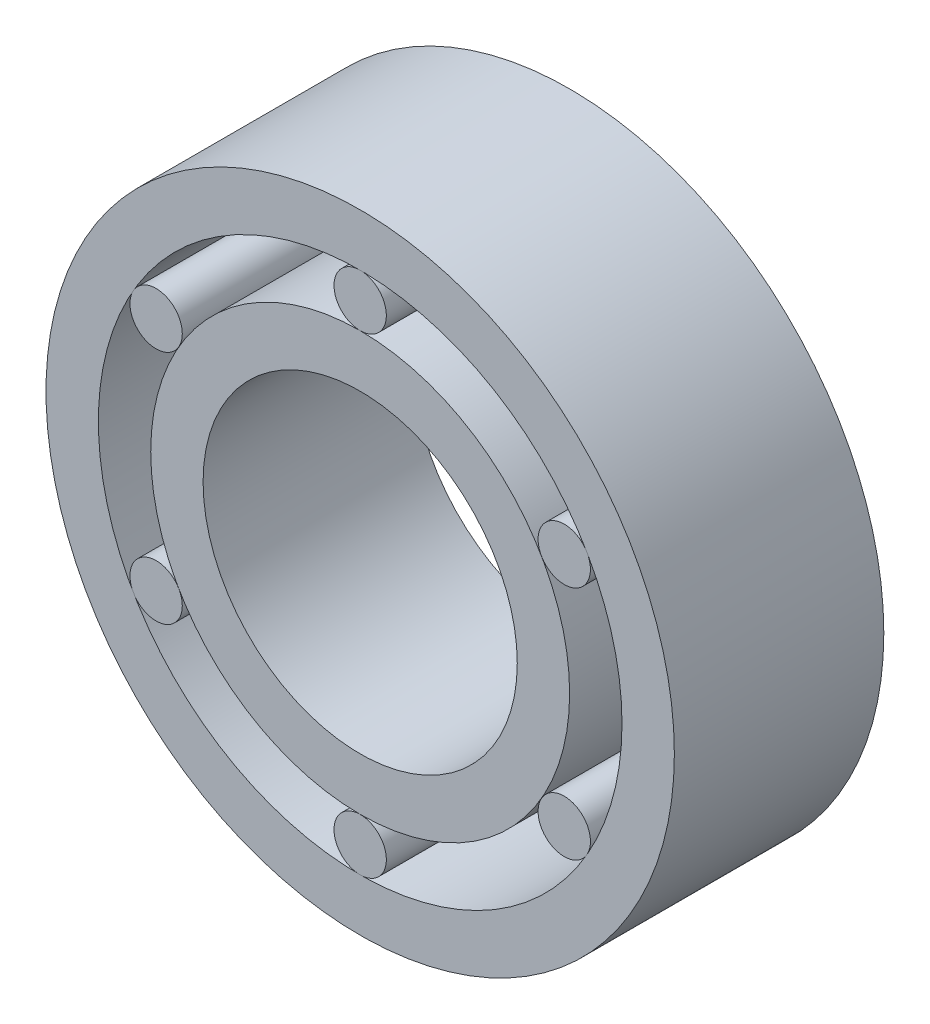
ISO-10303-21;
HEADER;
FILE_DESCRIPTION(('STEP AP214'),'2;1');
FILE_NAME('part.step','',(''),(''),'','','');
FILE_SCHEMA(('AUTOMOTIVE_DESIGN { 1 0 10303 214 1 1 1 1 }'));
ENDSEC;
DATA;
#1=APPLICATION_CONTEXT('core data for automotive mechanical design processes');
#2=APPLICATION_PROTOCOL_DEFINITION('international standard','automotive_design',2000,#1);
#3=PRODUCT_CONTEXT('',#1,'mechanical');
#4=PRODUCT('Part','Part','',(#3));
#5=PRODUCT_RELATED_PRODUCT_CATEGORY('part','',(#4));
#6=PRODUCT_DEFINITION_FORMATION('','',#4);
#7=PRODUCT_DEFINITION_CONTEXT('part definition',#1,'design');
#8=PRODUCT_DEFINITION('design','',#6,#7);
#9=PRODUCT_DEFINITION_SHAPE('','',#8);
#10=(LENGTH_UNIT() NAMED_UNIT(*) SI_UNIT(.MILLI.,.METRE.));
#11=(NAMED_UNIT(*) PLANE_ANGLE_UNIT() SI_UNIT($,.RADIAN.));
#12=(NAMED_UNIT(*) SI_UNIT($,.STERADIAN.) SOLID_ANGLE_UNIT());
#13=UNCERTAINTY_MEASURE_WITH_UNIT(LENGTH_MEASURE(1.E-05),#10,'distance_accuracy_value','');
#14=(GEOMETRIC_REPRESENTATION_CONTEXT(3) GLOBAL_UNCERTAINTY_ASSIGNED_CONTEXT((#13)) GLOBAL_UNIT_ASSIGNED_CONTEXT((#10,
#11,#12)) REPRESENTATION_CONTEXT('',''));
#15=CARTESIAN_POINT('',(0.,0.,0.));
#16=DIRECTION('',(0.,0.,1.));
#17=DIRECTION('',(1.,0.,0.));
#18=AXIS2_PLACEMENT_3D('',#15,#16,#17);
#19=CARTESIAN_POINT('',(-3.89711431702985,-2.25000000000008,4.));
#20=DIRECTION('',(0.,0.,-1.));
#21=DIRECTION('',(-1.,0.,0.));
#22=AXIS2_PLACEMENT_3D('',#19,#20,#21);
#23=CYLINDRICAL_SURFACE('',#22,0.5);
#24=CARTESIAN_POINT('',(-3.89711431702985,-2.25000000000008,4.));
#25=DIRECTION('',(0.,0.,1.));
#26=DIRECTION('',(1.,0.,0.));
#27=AXIS2_PLACEMENT_3D('',#24,#25,#26);
#28=CIRCLE('',#27,0.5);
#29=CARTESIAN_POINT('',(-3.39711431702985,-2.25000000000008,4.));
#30=VERTEX_POINT('',#29);
#31=EDGE_CURVE('E12',#30,#30,#28,.T.);
#32=ORIENTED_EDGE('',*,*,#31,.F.);
#33=EDGE_LOOP('',(#32));
#34=FACE_BOUND('',#33,.T.);
#35=CARTESIAN_POINT('',(-3.89711431702985,-2.25000000000008,0.));
#36=DIRECTION('',(0.,0.,1.));
#37=DIRECTION('',(1.,0.,0.));
#38=AXIS2_PLACEMENT_3D('',#35,#36,#37);
#39=CIRCLE('',#38,0.5);
#40=CARTESIAN_POINT('',(-3.39711431702985,-2.25000000000008,0.));
#41=VERTEX_POINT('',#40);
#42=EDGE_CURVE('E111',#41,#41,#39,.T.);
#43=ORIENTED_EDGE('',*,*,#42,.T.);
#44=EDGE_LOOP('',(#43));
#45=FACE_BOUND('',#44,.T.);
#46=ADVANCED_FACE('F108',(#34,#45),#23,.T.);
#47=CARTESIAN_POINT('',(0.,0.,4.));
#48=DIRECTION('',(0.,0.,1.));
#49=DIRECTION('',(1.,0.,0.));
#50=AXIS2_PLACEMENT_3D('',#47,#48,#49);
#51=PLANE('',#50);
#52=ORIENTED_EDGE('',*,*,#31,.T.);
#53=EDGE_LOOP('',(#52));
#54=FACE_BOUND('',#53,.T.);
#55=ADVANCED_FACE('F123',(#54),#51,.T.);
#56=CARTESIAN_POINT('',(0.,0.,0.));
#57=DIRECTION('',(0.,0.,1.));
#58=DIRECTION('',(1.,0.,0.));
#59=AXIS2_PLACEMENT_3D('',#56,#57,#58);
#60=PLANE('',#59);
#61=ORIENTED_EDGE('',*,*,#42,.F.);
#62=EDGE_LOOP('',(#61));
#63=FACE_BOUND('',#62,.T.);
#64=ADVANCED_FACE('F121',(#63),#60,.F.);
#65=CLOSED_SHELL('',(#46,#55,#64));
#66=MANIFOLD_SOLID_BREP('B2',#65);
#67=CARTESIAN_POINT('',(1.70101630202722E-13,-4.5,4.));
#68=DIRECTION('',(0.,0.,-1.));
#69=DIRECTION('',(-1.,0.,0.));
#70=AXIS2_PLACEMENT_3D('',#67,#68,#69);
#71=CYLINDRICAL_SURFACE('',#70,0.5);
#72=CARTESIAN_POINT('',(1.70101630202722E-13,-4.5,4.));
#73=DIRECTION('',(0.,0.,1.));
#74=DIRECTION('',(1.,0.,0.));
#75=AXIS2_PLACEMENT_3D('',#72,#73,#74);
#76=CIRCLE('',#75,0.5);
#77=CARTESIAN_POINT('',(0.50000000000017,-4.5,4.));
#78=VERTEX_POINT('',#77);
#79=EDGE_CURVE('E107',#78,#78,#76,.T.);
#80=ORIENTED_EDGE('',*,*,#79,.F.);
#81=EDGE_LOOP('',(#80));
#82=FACE_BOUND('',#81,.T.);
#83=CARTESIAN_POINT('',(1.70101630202722E-13,-4.5,0.));
#84=DIRECTION('',(0.,0.,1.));
#85=DIRECTION('',(1.,0.,0.));
#86=AXIS2_PLACEMENT_3D('',#83,#84,#85);
#87=CIRCLE('',#86,0.5);
#88=CARTESIAN_POINT('',(0.50000000000017,-4.5,0.));
#89=VERTEX_POINT('',#88);
#90=EDGE_CURVE('E160',#89,#89,#87,.T.);
#91=ORIENTED_EDGE('',*,*,#90,.T.);
#92=EDGE_LOOP('',(#91));
#93=FACE_BOUND('',#92,.T.);
#94=ADVANCED_FACE('F157',(#82,#93),#71,.T.);
#95=CARTESIAN_POINT('',(0.,0.,4.));
#96=DIRECTION('',(0.,0.,1.));
#97=DIRECTION('',(1.,0.,0.));
#98=AXIS2_PLACEMENT_3D('',#95,#96,#97);
#99=PLANE('',#98);
#100=ORIENTED_EDGE('',*,*,#79,.T.);
#101=EDGE_LOOP('',(#100));
#102=FACE_BOUND('',#101,.T.);
#103=ADVANCED_FACE('F172',(#102),#99,.T.);
#104=CARTESIAN_POINT('',(0.,0.,0.));
#105=DIRECTION('',(0.,0.,1.));
#106=DIRECTION('',(1.,0.,0.));
#107=AXIS2_PLACEMENT_3D('',#104,#105,#106);
#108=PLANE('',#107);
#109=ORIENTED_EDGE('',*,*,#90,.F.);
#110=EDGE_LOOP('',(#109));
#111=FACE_BOUND('',#110,.T.);
#112=ADVANCED_FACE('F170',(#111),#108,.F.);
#113=CLOSED_SHELL('',(#94,#103,#112));
#114=MANIFOLD_SOLID_BREP('B7',#113);
#115=CARTESIAN_POINT('',(3.8971143170301,-2.24999999999993,4.));
#116=DIRECTION('',(0.,0.,-1.));
#117=DIRECTION('',(-1.,0.,0.));
#118=AXIS2_PLACEMENT_3D('',#115,#116,#117);
#119=CYLINDRICAL_SURFACE('',#118,0.5);
#120=CARTESIAN_POINT('',(3.8971143170301,-2.24999999999993,4.));
#121=DIRECTION('',(0.,0.,1.));
#122=DIRECTION('',(1.,0.,0.));
#123=AXIS2_PLACEMENT_3D('',#120,#121,#122);
#124=CIRCLE('',#123,0.5);
#125=CARTESIAN_POINT('',(4.3971143170301,-2.24999999999993,4.));
#126=VERTEX_POINT('',#125);
#127=EDGE_CURVE('E156',#126,#126,#124,.T.);
#128=ORIENTED_EDGE('',*,*,#127,.F.);
#129=EDGE_LOOP('',(#128));
#130=FACE_BOUND('',#129,.T.);
#131=CARTESIAN_POINT('',(3.8971143170301,-2.24999999999993,0.));
#132=DIRECTION('',(0.,0.,1.));
#133=DIRECTION('',(1.,0.,0.));
#134=AXIS2_PLACEMENT_3D('',#131,#132,#133);
#135=CIRCLE('',#134,0.5);
#136=CARTESIAN_POINT('',(4.3971143170301,-2.24999999999993,0.));
#137=VERTEX_POINT('',#136);
#138=EDGE_CURVE('E209',#137,#137,#135,.T.);
#139=ORIENTED_EDGE('',*,*,#138,.T.);
#140=EDGE_LOOP('',(#139));
#141=FACE_BOUND('',#140,.T.);
#142=ADVANCED_FACE('F206',(#130,#141),#119,.T.);
#143=CARTESIAN_POINT('',(0.,0.,4.));
#144=DIRECTION('',(0.,0.,1.));
#145=DIRECTION('',(1.,0.,0.));
#146=AXIS2_PLACEMENT_3D('',#143,#144,#145);
#147=PLANE('',#146);
#148=ORIENTED_EDGE('',*,*,#127,.T.);
#149=EDGE_LOOP('',(#148));
#150=FACE_BOUND('',#149,.T.);
#151=ADVANCED_FACE('F221',(#150),#147,.T.);
#152=CARTESIAN_POINT('',(0.,0.,0.));
#153=DIRECTION('',(0.,0.,1.));
#154=DIRECTION('',(1.,0.,0.));
#155=AXIS2_PLACEMENT_3D('',#152,#153,#154);
#156=PLANE('',#155);
#157=ORIENTED_EDGE('',*,*,#138,.F.);
#158=EDGE_LOOP('',(#157));
#159=FACE_BOUND('',#158,.T.);
#160=ADVANCED_FACE('F219',(#159),#156,.F.);
#161=CLOSED_SHELL('',(#142,#151,#160));
#162=MANIFOLD_SOLID_BREP('B102',#161);
#163=CARTESIAN_POINT('',(3.89711431703002,2.25000000000008,4.));
#164=DIRECTION('',(0.,0.,-1.));
#165=DIRECTION('',(-1.,0.,0.));
#166=AXIS2_PLACEMENT_3D('',#163,#164,#165);
#167=CYLINDRICAL_SURFACE('',#166,0.5);
#168=CARTESIAN_POINT('',(3.89711431703002,2.25000000000008,4.));
#169=DIRECTION('',(0.,0.,1.));
#170=DIRECTION('',(1.,0.,0.));
#171=AXIS2_PLACEMENT_3D('',#168,#169,#170);
#172=CIRCLE('',#171,0.5);
#173=CARTESIAN_POINT('',(4.39711431703002,2.25000000000008,4.));
#174=VERTEX_POINT('',#173);
#175=EDGE_CURVE('E205',#174,#174,#172,.T.);
#176=ORIENTED_EDGE('',*,*,#175,.F.);
#177=EDGE_LOOP('',(#176));
#178=FACE_BOUND('',#177,.T.);
#179=CARTESIAN_POINT('',(3.89711431703002,2.25000000000008,0.));
#180=DIRECTION('',(0.,0.,1.));
#181=DIRECTION('',(1.,0.,0.));
#182=AXIS2_PLACEMENT_3D('',#179,#180,#181);
#183=CIRCLE('',#182,0.5);
#184=CARTESIAN_POINT('',(4.39711431703002,2.25000000000008,0.));
#185=VERTEX_POINT('',#184);
#186=EDGE_CURVE('E258',#185,#185,#183,.T.);
#187=ORIENTED_EDGE('',*,*,#186,.T.);
#188=EDGE_LOOP('',(#187));
#189=FACE_BOUND('',#188,.T.);
#190=ADVANCED_FACE('F255',(#178,#189),#167,.T.);
#191=CARTESIAN_POINT('',(0.,0.,4.));
#192=DIRECTION('',(0.,0.,1.));
#193=DIRECTION('',(1.,0.,0.));
#194=AXIS2_PLACEMENT_3D('',#191,#192,#193);
#195=PLANE('',#194);
#196=ORIENTED_EDGE('',*,*,#175,.T.);
#197=EDGE_LOOP('',(#196));
#198=FACE_BOUND('',#197,.T.);
#199=ADVANCED_FACE('F270',(#198),#195,.T.);
#200=CARTESIAN_POINT('',(0.,0.,0.));
#201=DIRECTION('',(0.,0.,1.));
#202=DIRECTION('',(1.,0.,0.));
#203=AXIS2_PLACEMENT_3D('',#200,#201,#202);
#204=PLANE('',#203);
#205=ORIENTED_EDGE('',*,*,#186,.F.);
#206=EDGE_LOOP('',(#205));
#207=FACE_BOUND('',#206,.T.);
#208=ADVANCED_FACE('F268',(#207),#204,.F.);
#209=CLOSED_SHELL('',(#190,#199,#208));
#210=MANIFOLD_SOLID_BREP('B151',#209);
#211=CARTESIAN_POINT('',(-3.89711431702993,2.24999999999992,4.));
#212=DIRECTION('',(0.,0.,-1.));
#213=DIRECTION('',(-1.,0.,0.));
#214=AXIS2_PLACEMENT_3D('',#211,#212,#213);
#215=CYLINDRICAL_SURFACE('',#214,0.5);
#216=CARTESIAN_POINT('',(-3.89711431702993,2.24999999999992,4.));
#217=DIRECTION('',(0.,0.,1.));
#218=DIRECTION('',(1.,0.,0.));
#219=AXIS2_PLACEMENT_3D('',#216,#217,#218);
#220=CIRCLE('',#219,0.5);
#221=CARTESIAN_POINT('',(-3.39711431702993,2.24999999999992,4.));
#222=VERTEX_POINT('',#221);
#223=EDGE_CURVE('E254',#222,#222,#220,.T.);
#224=ORIENTED_EDGE('',*,*,#223,.F.);
#225=EDGE_LOOP('',(#224));
#226=FACE_BOUND('',#225,.T.);
#227=CARTESIAN_POINT('',(-3.89711431702993,2.24999999999992,0.));
#228=DIRECTION('',(0.,0.,1.));
#229=DIRECTION('',(1.,0.,0.));
#230=AXIS2_PLACEMENT_3D('',#227,#228,#229);
#231=CIRCLE('',#230,0.5);
#232=CARTESIAN_POINT('',(-3.39711431702993,2.24999999999992,0.));
#233=VERTEX_POINT('',#232);
#234=EDGE_CURVE('E307',#233,#233,#231,.T.);
#235=ORIENTED_EDGE('',*,*,#234,.T.);
#236=EDGE_LOOP('',(#235));
#237=FACE_BOUND('',#236,.T.);
#238=ADVANCED_FACE('F304',(#226,#237),#215,.T.);
#239=CARTESIAN_POINT('',(0.,0.,4.));
#240=DIRECTION('',(0.,0.,1.));
#241=DIRECTION('',(1.,0.,0.));
#242=AXIS2_PLACEMENT_3D('',#239,#240,#241);
#243=PLANE('',#242);
#244=ORIENTED_EDGE('',*,*,#223,.T.);
#245=EDGE_LOOP('',(#244));
#246=FACE_BOUND('',#245,.T.);
#247=ADVANCED_FACE('F319',(#246),#243,.T.);
#248=CARTESIAN_POINT('',(0.,0.,0.));
#249=DIRECTION('',(0.,0.,1.));
#250=DIRECTION('',(1.,0.,0.));
#251=AXIS2_PLACEMENT_3D('',#248,#249,#250);
#252=PLANE('',#251);
#253=ORIENTED_EDGE('',*,*,#234,.F.);
#254=EDGE_LOOP('',(#253));
#255=FACE_BOUND('',#254,.T.);
#256=ADVANCED_FACE('F317',(#255),#252,.F.);
#257=CLOSED_SHELL('',(#238,#247,#256));
#258=MANIFOLD_SOLID_BREP('B200',#257);
#259=CARTESIAN_POINT('',(0.,0.,4.));
#260=DIRECTION('',(0.,0.,-1.));
#261=DIRECTION('',(-1.,0.,0.));
#262=AXIS2_PLACEMENT_3D('',#259,#260,#261);
#263=CYLINDRICAL_SURFACE('',#262,5.);
#264=CARTESIAN_POINT('',(0.,0.,4.));
#265=DIRECTION('',(0.,0.,1.));
#266=DIRECTION('',(1.,0.,0.));
#267=AXIS2_PLACEMENT_3D('',#264,#265,#266);
#268=CIRCLE('',#267,5.);
#269=CARTESIAN_POINT('',(5.,0.,4.));
#270=VERTEX_POINT('',#269);
#271=EDGE_CURVE('E360',#270,#270,#268,.T.);
#272=ORIENTED_EDGE('',*,*,#271,.T.);
#273=EDGE_LOOP('',(#272));
#274=FACE_BOUND('',#273,.T.);
#275=CARTESIAN_POINT('',(0.,0.,0.));
#276=DIRECTION('',(0.,0.,1.));
#277=DIRECTION('',(1.,0.,0.));
#278=AXIS2_PLACEMENT_3D('',#275,#276,#277);
#279=CIRCLE('',#278,5.);
#280=CARTESIAN_POINT('',(5.,0.,0.));
#281=VERTEX_POINT('',#280);
#282=EDGE_CURVE('E366',#281,#281,#279,.T.);
#283=ORIENTED_EDGE('',*,*,#282,.F.);
#284=EDGE_LOOP('',(#283));
#285=FACE_BOUND('',#284,.T.);
#286=ADVANCED_FACE('F353',(#274,#285),#263,.F.);
#287=CARTESIAN_POINT('',(0.,0.,4.));
#288=DIRECTION('',(0.,0.,-1.));
#289=DIRECTION('',(-1.,0.,0.));
#290=AXIS2_PLACEMENT_3D('',#287,#288,#289);
#291=CYLINDRICAL_SURFACE('',#290,6.);
#292=CARTESIAN_POINT('',(0.,0.,4.));
#293=DIRECTION('',(0.,0.,1.));
#294=DIRECTION('',(1.,0.,0.));
#295=AXIS2_PLACEMENT_3D('',#292,#293,#294);
#296=CIRCLE('',#295,6.);
#297=CARTESIAN_POINT('',(6.,0.,4.));
#298=VERTEX_POINT('',#297);
#299=EDGE_CURVE('E303',#298,#298,#296,.T.);
#300=ORIENTED_EDGE('',*,*,#299,.F.);
#301=EDGE_LOOP('',(#300));
#302=FACE_BOUND('',#301,.T.);
#303=CARTESIAN_POINT('',(0.,0.,0.));
#304=DIRECTION('',(0.,0.,1.));
#305=DIRECTION('',(1.,0.,0.));
#306=AXIS2_PLACEMENT_3D('',#303,#304,#305);
#307=CIRCLE('',#306,6.);
#308=CARTESIAN_POINT('',(6.,0.,0.));
#309=VERTEX_POINT('',#308);
#310=EDGE_CURVE('E356',#309,#309,#307,.T.);
#311=ORIENTED_EDGE('',*,*,#310,.T.);
#312=EDGE_LOOP('',(#311));
#313=FACE_BOUND('',#312,.T.);
#314=ADVANCED_FACE('F373',(#302,#313),#291,.T.);
#315=CARTESIAN_POINT('',(0.,0.,4.));
#316=DIRECTION('',(0.,0.,1.));
#317=DIRECTION('',(1.,0.,0.));
#318=AXIS2_PLACEMENT_3D('',#315,#316,#317);
#319=PLANE('',#318);
#320=ORIENTED_EDGE('',*,*,#271,.F.);
#321=EDGE_LOOP('',(#320));
#322=FACE_BOUND('',#321,.T.);
#323=ORIENTED_EDGE('',*,*,#299,.T.);
#324=EDGE_LOOP('',(#323));
#325=FACE_BOUND('',#324,.T.);
#326=ADVANCED_FACE('F377',(#322,#325),#319,.T.);
#327=CARTESIAN_POINT('',(0.,0.,0.));
#328=DIRECTION('',(0.,0.,1.));
#329=DIRECTION('',(1.,0.,0.));
#330=AXIS2_PLACEMENT_3D('',#327,#328,#329);
#331=PLANE('',#330);
#332=ORIENTED_EDGE('',*,*,#282,.T.);
#333=EDGE_LOOP('',(#332));
#334=FACE_BOUND('',#333,.T.);
#335=ORIENTED_EDGE('',*,*,#310,.F.);
#336=EDGE_LOOP('',(#335));
#337=FACE_BOUND('',#336,.T.);
#338=ADVANCED_FACE('F375',(#334,#337),#331,.F.);
#339=CLOSED_SHELL('',(#286,#314,#326,#338));
#340=MANIFOLD_SOLID_BREP('B249',#339);
#341=CARTESIAN_POINT('',(0.,4.5,4.));
#342=DIRECTION('',(0.,0.,-1.));
#343=DIRECTION('',(-1.,0.,0.));
#344=AXIS2_PLACEMENT_3D('',#341,#342,#343);
#345=CYLINDRICAL_SURFACE('',#344,0.5);
#346=CARTESIAN_POINT('',(0.,4.5,4.));
#347=DIRECTION('',(0.,0.,1.));
#348=DIRECTION('',(1.,0.,0.));
#349=AXIS2_PLACEMENT_3D('',#346,#347,#348);
#350=CIRCLE('',#349,0.5);
#351=CARTESIAN_POINT('',(0.5,4.5,4.));
#352=VERTEX_POINT('',#351);
#353=EDGE_CURVE('E352',#352,#352,#350,.T.);
#354=ORIENTED_EDGE('',*,*,#353,.F.);
#355=EDGE_LOOP('',(#354));
#356=FACE_BOUND('',#355,.T.);
#357=CARTESIAN_POINT('',(0.,4.5,0.));
#358=DIRECTION('',(0.,0.,1.));
#359=DIRECTION('',(1.,0.,0.));
#360=AXIS2_PLACEMENT_3D('',#357,#358,#359);
#361=CIRCLE('',#360,0.5);
#362=CARTESIAN_POINT('',(0.5,4.5,0.));
#363=VERTEX_POINT('',#362);
#364=EDGE_CURVE('E425',#363,#363,#361,.T.);
#365=ORIENTED_EDGE('',*,*,#364,.T.);
#366=EDGE_LOOP('',(#365));
#367=FACE_BOUND('',#366,.T.);
#368=ADVANCED_FACE('F422',(#356,#367),#345,.T.);
#369=CARTESIAN_POINT('',(0.,0.,4.));
#370=DIRECTION('',(0.,0.,1.));
#371=DIRECTION('',(1.,0.,0.));
#372=AXIS2_PLACEMENT_3D('',#369,#370,#371);
#373=PLANE('',#372);
#374=ORIENTED_EDGE('',*,*,#353,.T.);
#375=EDGE_LOOP('',(#374));
#376=FACE_BOUND('',#375,.T.);
#377=ADVANCED_FACE('F437',(#376),#373,.T.);
#378=CARTESIAN_POINT('',(0.,0.,0.));
#379=DIRECTION('',(0.,0.,1.));
#380=DIRECTION('',(1.,0.,0.));
#381=AXIS2_PLACEMENT_3D('',#378,#379,#380);
#382=PLANE('',#381);
#383=ORIENTED_EDGE('',*,*,#364,.F.);
#384=EDGE_LOOP('',(#383));
#385=FACE_BOUND('',#384,.T.);
#386=ADVANCED_FACE('F435',(#385),#382,.F.);
#387=CLOSED_SHELL('',(#368,#377,#386));
#388=MANIFOLD_SOLID_BREP('B298',#387);
#389=CARTESIAN_POINT('',(0.,0.,4.));
#390=DIRECTION('',(0.,0.,-1.));
#391=DIRECTION('',(-1.,0.,0.));
#392=AXIS2_PLACEMENT_3D('',#389,#390,#391);
#393=CYLINDRICAL_SURFACE('',#392,3.);
#394=CARTESIAN_POINT('',(0.,0.,4.));
#395=DIRECTION('',(0.,0.,1.));
#396=DIRECTION('',(1.,0.,0.));
#397=AXIS2_PLACEMENT_3D('',#394,#395,#396);
#398=CIRCLE('',#397,3.);
#399=CARTESIAN_POINT('',(3.,0.,4.));
#400=VERTEX_POINT('',#399);
#401=EDGE_CURVE('E470',#400,#400,#398,.T.);
#402=ORIENTED_EDGE('',*,*,#401,.T.);
#403=EDGE_LOOP('',(#402));
#404=FACE_BOUND('',#403,.T.);
#405=CARTESIAN_POINT('',(0.,0.,0.));
#406=DIRECTION('',(0.,0.,1.));
#407=DIRECTION('',(1.,0.,0.));
#408=AXIS2_PLACEMENT_3D('',#405,#406,#407);
#409=CIRCLE('',#408,3.);
#410=CARTESIAN_POINT('',(3.,0.,0.));
#411=VERTEX_POINT('',#410);
#412=EDGE_CURVE('E476',#411,#411,#409,.T.);
#413=ORIENTED_EDGE('',*,*,#412,.F.);
#414=EDGE_LOOP('',(#413));
#415=FACE_BOUND('',#414,.T.);
#416=ADVANCED_FACE('F463',(#404,#415),#393,.F.);
#417=CARTESIAN_POINT('',(0.,0.,4.));
#418=DIRECTION('',(0.,0.,-1.));
#419=DIRECTION('',(-1.,0.,0.));
#420=AXIS2_PLACEMENT_3D('',#417,#418,#419);
#421=CYLINDRICAL_SURFACE('',#420,4.);
#422=CARTESIAN_POINT('',(0.,0.,4.));
#423=DIRECTION('',(0.,0.,1.));
#424=DIRECTION('',(1.,0.,0.));
#425=AXIS2_PLACEMENT_3D('',#422,#423,#424);
#426=CIRCLE('',#425,4.);
#427=CARTESIAN_POINT('',(4.,0.,4.));
#428=VERTEX_POINT('',#427);
#429=EDGE_CURVE('E421',#428,#428,#426,.T.);
#430=ORIENTED_EDGE('',*,*,#429,.F.);
#431=EDGE_LOOP('',(#430));
#432=FACE_BOUND('',#431,.T.);
#433=CARTESIAN_POINT('',(0.,0.,0.));
#434=DIRECTION('',(0.,0.,1.));
#435=DIRECTION('',(1.,0.,0.));
#436=AXIS2_PLACEMENT_3D('',#433,#434,#435);
#437=CIRCLE('',#436,4.);
#438=CARTESIAN_POINT('',(4.,0.,0.));
#439=VERTEX_POINT('',#438);
#440=EDGE_CURVE('E466',#439,#439,#437,.T.);
#441=ORIENTED_EDGE('',*,*,#440,.T.);
#442=EDGE_LOOP('',(#441));
#443=FACE_BOUND('',#442,.T.);
#444=ADVANCED_FACE('F483',(#432,#443),#421,.T.);
#445=CARTESIAN_POINT('',(0.,0.,4.));
#446=DIRECTION('',(0.,0.,1.));
#447=DIRECTION('',(1.,0.,0.));
#448=AXIS2_PLACEMENT_3D('',#445,#446,#447);
#449=PLANE('',#448);
#450=ORIENTED_EDGE('',*,*,#401,.F.);
#451=EDGE_LOOP('',(#450));
#452=FACE_BOUND('',#451,.T.);
#453=ORIENTED_EDGE('',*,*,#429,.T.);
#454=EDGE_LOOP('',(#453));
#455=FACE_BOUND('',#454,.T.);
#456=ADVANCED_FACE('F487',(#452,#455),#449,.T.);
#457=CARTESIAN_POINT('',(0.,0.,0.));
#458=DIRECTION('',(0.,0.,1.));
#459=DIRECTION('',(1.,0.,0.));
#460=AXIS2_PLACEMENT_3D('',#457,#458,#459);
#461=PLANE('',#460);
#462=ORIENTED_EDGE('',*,*,#412,.T.);
#463=EDGE_LOOP('',(#462));
#464=FACE_BOUND('',#463,.T.);
#465=ORIENTED_EDGE('',*,*,#440,.F.);
#466=EDGE_LOOP('',(#465));
#467=FACE_BOUND('',#466,.T.);
#468=ADVANCED_FACE('F485',(#464,#467),#461,.F.);
#469=CLOSED_SHELL('',(#416,#444,#456,#468));
#470=MANIFOLD_SOLID_BREP('B347',#469);
#471=ADVANCED_BREP_SHAPE_REPRESENTATION('',(#18,#66,#114,#162,#210,#258,#340,#388,#470),#14);
#472=SHAPE_DEFINITION_REPRESENTATION(#9,#471);
ENDSEC;
END-ISO-10303-21;
